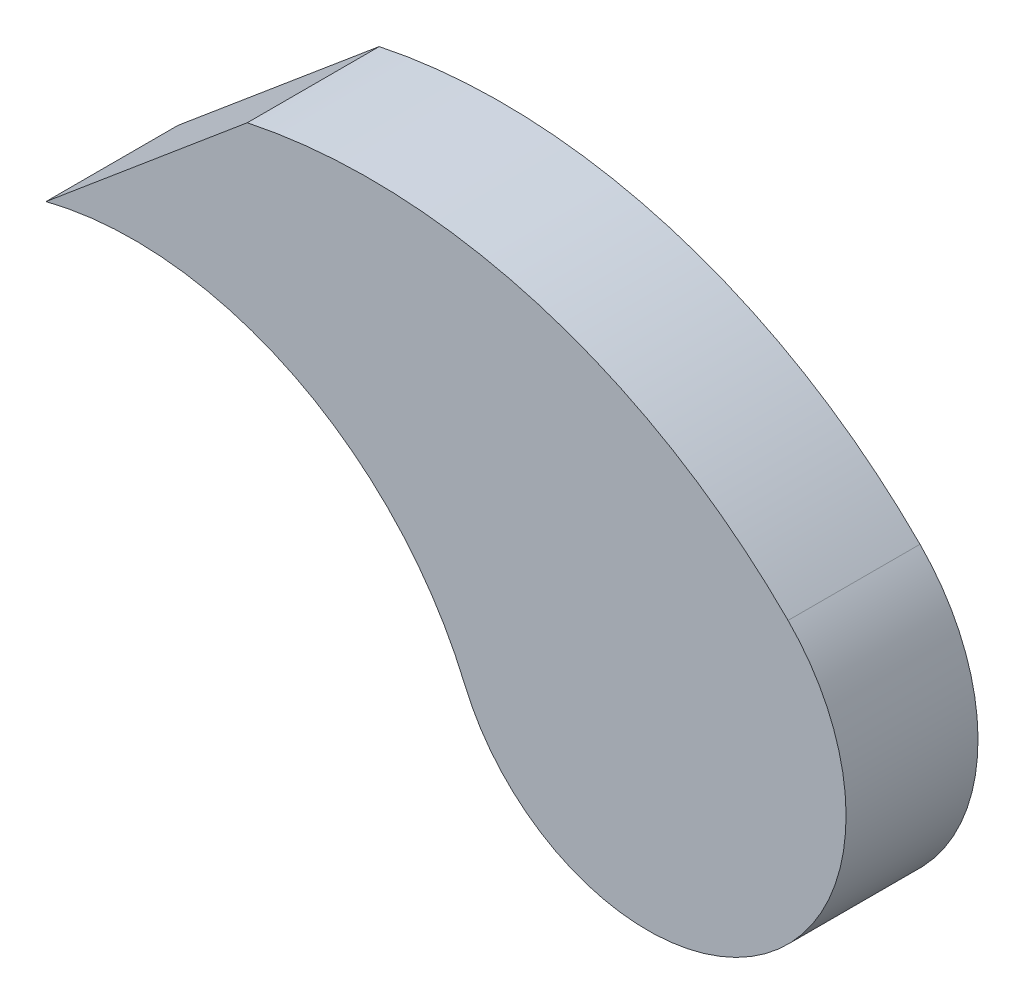
ISO-10303-21;
HEADER;
FILE_DESCRIPTION(('STEP AP214'),'2;1');
FILE_NAME('part.step','',(''),(''),'','','');
FILE_SCHEMA(('AUTOMOTIVE_DESIGN { 1 0 10303 214 1 1 1 1 }'));
ENDSEC;
DATA;
#1=APPLICATION_CONTEXT('core data for automotive mechanical design processes');
#2=APPLICATION_PROTOCOL_DEFINITION('international standard','automotive_design',2000,#1);
#3=PRODUCT_CONTEXT('',#1,'mechanical');
#4=PRODUCT('Part','Part','',(#3));
#5=PRODUCT_RELATED_PRODUCT_CATEGORY('part','',(#4));
#6=PRODUCT_DEFINITION_FORMATION('','',#4);
#7=PRODUCT_DEFINITION_CONTEXT('part definition',#1,'design');
#8=PRODUCT_DEFINITION('design','',#6,#7);
#9=PRODUCT_DEFINITION_SHAPE('','',#8);
#10=(LENGTH_UNIT() NAMED_UNIT(*) SI_UNIT(.MILLI.,.METRE.));
#11=(NAMED_UNIT(*) PLANE_ANGLE_UNIT() SI_UNIT($,.RADIAN.));
#12=(NAMED_UNIT(*) SI_UNIT($,.STERADIAN.) SOLID_ANGLE_UNIT());
#13=UNCERTAINTY_MEASURE_WITH_UNIT(LENGTH_MEASURE(1.E-05),#10,'distance_accuracy_value','');
#14=(GEOMETRIC_REPRESENTATION_CONTEXT(3) GLOBAL_UNCERTAINTY_ASSIGNED_CONTEXT((#13)) GLOBAL_UNIT_ASSIGNED_CONTEXT((#10,
#11,#12)) REPRESENTATION_CONTEXT('',''));
#15=CARTESIAN_POINT('',(0.,0.,0.));
#16=DIRECTION('',(0.,0.,1.));
#17=DIRECTION('',(1.,0.,0.));
#18=AXIS2_PLACEMENT_3D('',#15,#16,#17);
#19=CARTESIAN_POINT('',(-12.3628985186526,-5.19798284505601,3.175));
#20=DIRECTION('',(0.,0.,-1.));
#21=DIRECTION('',(-1.,0.,0.));
#22=AXIS2_PLACEMENT_3D('',#19,#20,#21);
#23=CYLINDRICAL_SURFACE('',#22,8.636);
#24=CARTESIAN_POINT('',(-12.3628985186526,-5.19798284505601,0.));
#25=DIRECTION('',(0.,0.,-1.));
#26=DIRECTION('',(1.,0.,0.));
#27=AXIS2_PLACEMENT_3D('',#24,#25,#26);
#28=CIRCLE('',#27,8.636);
#29=CARTESIAN_POINT('',(-14.478,3.175,0.));
#30=VERTEX_POINT('',#29);
#31=CARTESIAN_POINT('',(-4.40194113921723,-1.85079692210327,0.));
#32=VERTEX_POINT('',#31);
#33=EDGE_CURVE('E99',#30,#32,#28,.T.);
#34=ORIENTED_EDGE('',*,*,#33,.T.);
#35=DIRECTION('',(0.,0.,-1.));
#36=VECTOR('',#35,1.);
#37=CARTESIAN_POINT('',(-4.40194113921723,-1.85079692210327,3.175));
#38=LINE('',#37,#36);
#39=CARTESIAN_POINT('',(-4.40194113921723,-1.85079692210327,3.175));
#40=VERTEX_POINT('',#39);
#41=EDGE_CURVE('E11',#40,#32,#38,.T.);
#42=ORIENTED_EDGE('',*,*,#41,.F.);
#43=CARTESIAN_POINT('',(-12.3628985186526,-5.19798284505601,3.175));
#44=DIRECTION('',(0.,0.,-1.));
#45=DIRECTION('',(1.,0.,0.));
#46=AXIS2_PLACEMENT_3D('',#43,#44,#45);
#47=CIRCLE('',#46,8.636);
#48=CARTESIAN_POINT('',(-14.478,3.175,3.175));
#49=VERTEX_POINT('',#48);
#50=EDGE_CURVE('E87',#49,#40,#47,.T.);
#51=ORIENTED_EDGE('',*,*,#50,.F.);
#52=DIRECTION('',(0.,0.,-1.));
#53=VECTOR('',#52,1.);
#54=CARTESIAN_POINT('',(-14.478,3.175,3.175));
#55=LINE('',#54,#53);
#56=EDGE_CURVE('E95',#49,#30,#55,.T.);
#57=ORIENTED_EDGE('',*,*,#56,.T.);
#58=EDGE_LOOP('',(#34,#42,#51,#57));
#59=FACE_BOUND('',#58,.T.);
#60=ADVANCED_FACE('F36',(#59),#23,.F.);
#61=CARTESIAN_POINT('',(0.,0.,3.175));
#62=DIRECTION('',(0.,0.,-1.));
#63=DIRECTION('',(-1.,0.,0.));
#64=AXIS2_PLACEMENT_3D('',#61,#62,#63);
#65=CYLINDRICAL_SURFACE('',#64,4.7752);
#66=CARTESIAN_POINT('',(0.,0.,0.));
#67=DIRECTION('',(0.,0.,1.));
#68=DIRECTION('',(1.,0.,0.));
#69=AXIS2_PLACEMENT_3D('',#66,#67,#68);
#70=CIRCLE('',#69,4.7752);
#71=CARTESIAN_POINT('',(3.3792029570035,3.37394760116081,0.));
#72=VERTEX_POINT('',#71);
#73=EDGE_CURVE('E91',#32,#72,#70,.T.);
#74=ORIENTED_EDGE('',*,*,#73,.T.);
#75=DIRECTION('',(0.,0.,-1.));
#76=VECTOR('',#75,1.);
#77=CARTESIAN_POINT('',(3.3792029570035,3.37394760116081,3.175));
#78=LINE('',#77,#76);
#79=CARTESIAN_POINT('',(3.3792029570035,3.37394760116081,3.175));
#80=VERTEX_POINT('',#79);
#81=EDGE_CURVE('E44',#80,#72,#78,.T.);
#82=ORIENTED_EDGE('',*,*,#81,.F.);
#83=CARTESIAN_POINT('',(0.,0.,3.175));
#84=DIRECTION('',(0.,0.,1.));
#85=DIRECTION('',(1.,0.,0.));
#86=AXIS2_PLACEMENT_3D('',#83,#84,#85);
#87=CIRCLE('',#86,4.7752);
#88=EDGE_CURVE('E82',#40,#80,#87,.T.);
#89=ORIENTED_EDGE('',*,*,#88,.F.);
#90=ORIENTED_EDGE('',*,*,#41,.T.);
#91=EDGE_LOOP('',(#74,#82,#89,#90));
#92=FACE_BOUND('',#91,.T.);
#93=ADVANCED_FACE('F90',(#92),#65,.T.);
#94=CARTESIAN_POINT('',(-6.68650797875161,-6.67610908314799,3.175));
#95=DIRECTION('',(0.,0.,-1.));
#96=DIRECTION('',(-1.,0.,0.));
#97=AXIS2_PLACEMENT_3D('',#94,#95,#96);
#98=CYLINDRICAL_SURFACE('',#97,14.224);
#99=CARTESIAN_POINT('',(-6.68650797875161,-6.67610908314799,0.));
#100=DIRECTION('',(0.,0.,1.));
#101=DIRECTION('',(1.,0.,0.));
#102=AXIS2_PLACEMENT_3D('',#99,#100,#101);
#103=CIRCLE('',#102,14.224);
#104=CARTESIAN_POINT('',(-9.63471339969708,7.239,0.));
#105=VERTEX_POINT('',#104);
#106=EDGE_CURVE('E69',#72,#105,#103,.T.);
#107=ORIENTED_EDGE('',*,*,#106,.T.);
#108=DIRECTION('',(0.,0.,-1.));
#109=VECTOR('',#108,1.);
#110=CARTESIAN_POINT('',(-9.63471339969708,7.239,3.175));
#111=LINE('',#110,#109);
#112=CARTESIAN_POINT('',(-9.63471339969708,7.239,3.175));
#113=VERTEX_POINT('',#112);
#114=EDGE_CURVE('E92',#113,#105,#111,.T.);
#115=ORIENTED_EDGE('',*,*,#114,.F.);
#116=CARTESIAN_POINT('',(-6.68650797875161,-6.67610908314799,3.175));
#117=DIRECTION('',(0.,0.,1.));
#118=DIRECTION('',(1.,0.,0.));
#119=AXIS2_PLACEMENT_3D('',#116,#117,#118);
#120=CIRCLE('',#119,14.224);
#121=EDGE_CURVE('E85',#80,#113,#120,.T.);
#122=ORIENTED_EDGE('',*,*,#121,.F.);
#123=ORIENTED_EDGE('',*,*,#81,.T.);
#124=EDGE_LOOP('',(#107,#115,#122,#123));
#125=FACE_BOUND('',#124,.T.);
#126=ADVANCED_FACE('F93',(#125),#98,.T.);
#127=CARTESIAN_POINT('',(-9.63471339969708,7.239,3.175));
#128=DIRECTION('',(0.642787609686535,-0.766044443118981,0.));
#129=DIRECTION('',(0.766044443118982,0.642787609686535,0.));
#130=AXIS2_PLACEMENT_3D('',#127,#128,#129);
#131=PLANE('',#130);
#132=DIRECTION('',(-0.766044443118981,-0.642787609686535,0.));
#133=VECTOR('',#132,1.);
#134=CARTESIAN_POINT('',(-9.63471339969708,7.239,0.));
#135=LINE('',#134,#133);
#136=EDGE_CURVE('E75',#105,#30,#135,.T.);
#137=ORIENTED_EDGE('',*,*,#136,.T.);
#138=ORIENTED_EDGE('',*,*,#56,.F.);
#139=DIRECTION('',(-0.766044443118981,-0.642787609686535,0.));
#140=VECTOR('',#139,1.);
#141=CARTESIAN_POINT('',(-9.63471339969708,7.239,3.175));
#142=LINE('',#141,#140);
#143=EDGE_CURVE('E52',#113,#49,#142,.T.);
#144=ORIENTED_EDGE('',*,*,#143,.F.);
#145=ORIENTED_EDGE('',*,*,#114,.T.);
#146=EDGE_LOOP('',(#137,#138,#144,#145));
#147=FACE_BOUND('',#146,.T.);
#148=ADVANCED_FACE('F106',(#147),#131,.F.);
#149=CARTESIAN_POINT('',(-12.3628985186526,-5.19798284505601,3.175));
#150=DIRECTION('',(0.,0.,1.));
#151=DIRECTION('',(1.,0.,0.));
#152=AXIS2_PLACEMENT_3D('',#149,#150,#151);
#153=PLANE('',#152);
#154=ORIENTED_EDGE('',*,*,#50,.T.);
#155=ORIENTED_EDGE('',*,*,#88,.T.);
#156=ORIENTED_EDGE('',*,*,#121,.T.);
#157=ORIENTED_EDGE('',*,*,#143,.T.);
#158=EDGE_LOOP('',(#154,#155,#156,#157));
#159=FACE_BOUND('',#158,.T.);
#160=ADVANCED_FACE('F83',(#159),#153,.T.);
#161=CARTESIAN_POINT('',(-12.3628985186526,-5.19798284505601,0.));
#162=DIRECTION('',(0.,0.,1.));
#163=DIRECTION('',(1.,0.,0.));
#164=AXIS2_PLACEMENT_3D('',#161,#162,#163);
#165=PLANE('',#164);
#166=ORIENTED_EDGE('',*,*,#33,.F.);
#167=ORIENTED_EDGE('',*,*,#136,.F.);
#168=ORIENTED_EDGE('',*,*,#106,.F.);
#169=ORIENTED_EDGE('',*,*,#73,.F.);
#170=EDGE_LOOP('',(#166,#167,#168,#169));
#171=FACE_BOUND('',#170,.T.);
#172=ADVANCED_FACE('F109',(#171),#165,.F.);
#173=CLOSED_SHELL('',(#60,#93,#126,#148,#160,#172));
#174=MANIFOLD_SOLID_BREP('B2',#173);
#175=ADVANCED_BREP_SHAPE_REPRESENTATION('',(#18,#174),#14);
#176=SHAPE_DEFINITION_REPRESENTATION(#9,#175);
ENDSEC;
END-ISO-10303-21;
